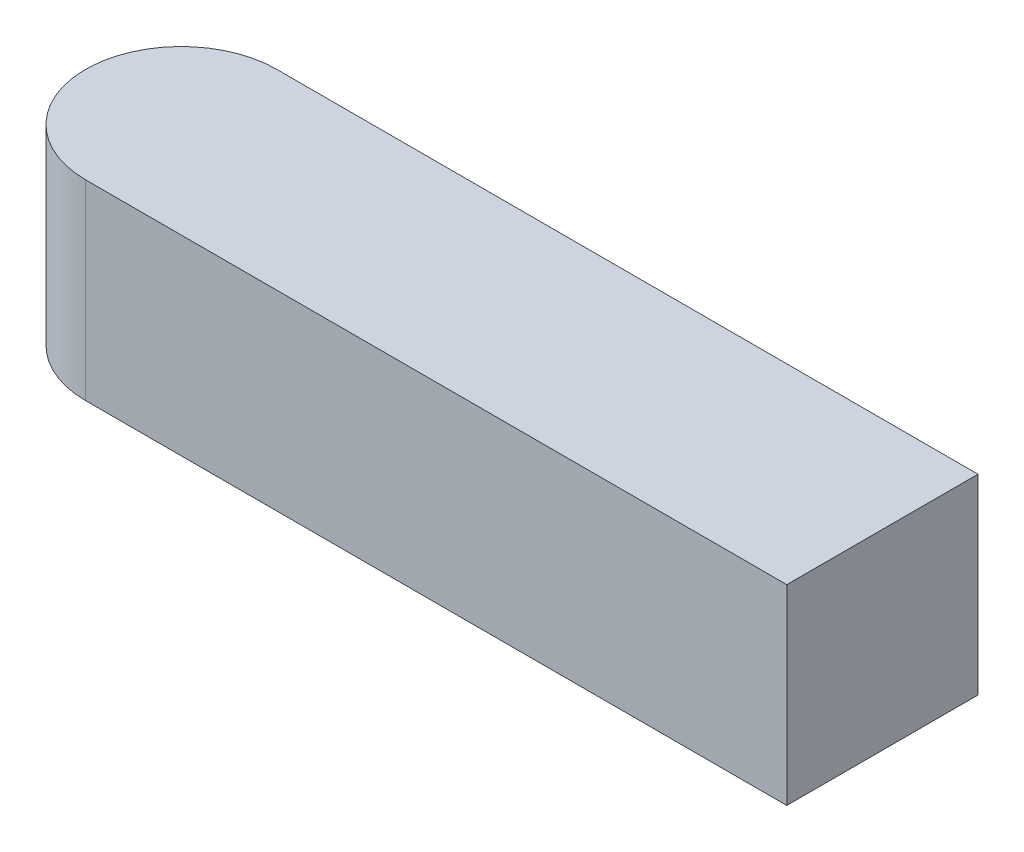
ISO-10303-21;
HEADER;
FILE_DESCRIPTION(('STEP AP214'),'2;1');
FILE_NAME('part.step','',(''),(''),'','','');
FILE_SCHEMA(('AUTOMOTIVE_DESIGN { 1 0 10303 214 1 1 1 1 }'));
ENDSEC;
DATA;
#1=APPLICATION_CONTEXT('core data for automotive mechanical design processes');
#2=APPLICATION_PROTOCOL_DEFINITION('international standard','automotive_design',2000,#1);
#3=PRODUCT_CONTEXT('',#1,'mechanical');
#4=PRODUCT('Part','Part','',(#3));
#5=PRODUCT_RELATED_PRODUCT_CATEGORY('part','',(#4));
#6=PRODUCT_DEFINITION_FORMATION('','',#4);
#7=PRODUCT_DEFINITION_CONTEXT('part definition',#1,'design');
#8=PRODUCT_DEFINITION('design','',#6,#7);
#9=PRODUCT_DEFINITION_SHAPE('','',#8);
#10=(LENGTH_UNIT() NAMED_UNIT(*) SI_UNIT(.MILLI.,.METRE.));
#11=(NAMED_UNIT(*) PLANE_ANGLE_UNIT() SI_UNIT($,.RADIAN.));
#12=(NAMED_UNIT(*) SI_UNIT($,.STERADIAN.) SOLID_ANGLE_UNIT());
#13=UNCERTAINTY_MEASURE_WITH_UNIT(LENGTH_MEASURE(1.E-05),#10,'distance_accuracy_value','');
#14=(GEOMETRIC_REPRESENTATION_CONTEXT(3) GLOBAL_UNCERTAINTY_ASSIGNED_CONTEXT((#13)) GLOBAL_UNIT_ASSIGNED_CONTEXT((#10,
#11,#12)) REPRESENTATION_CONTEXT('',''));
#15=CARTESIAN_POINT('',(0.,0.,0.));
#16=DIRECTION('',(0.,0.,1.));
#17=DIRECTION('',(1.,0.,0.));
#18=AXIS2_PLACEMENT_3D('',#15,#16,#17);
#19=CARTESIAN_POINT('',(-44.,12.,0.));
#20=DIRECTION('',(0.,-1.,0.));
#21=DIRECTION('',(0.,0.,-1.));
#22=AXIS2_PLACEMENT_3D('',#19,#20,#21);
#23=CYLINDRICAL_SURFACE('',#22,6.00000000000002);
#24=CARTESIAN_POINT('',(-44.,0.,0.));
#25=DIRECTION('',(0.,1.,0.));
#26=DIRECTION('',(0.,0.,1.));
#27=AXIS2_PLACEMENT_3D('',#24,#25,#26);
#28=CIRCLE('',#27,6.00000000000002);
#29=CARTESIAN_POINT('',(-44.,0.,-6.00000000000002));
#30=VERTEX_POINT('',#29);
#31=CARTESIAN_POINT('',(-44.,0.,6.00000000000002));
#32=VERTEX_POINT('',#31);
#33=EDGE_CURVE('E84',#30,#32,#28,.T.);
#34=ORIENTED_EDGE('',*,*,#33,.T.);
#35=DIRECTION('',(0.,-1.,0.));
#36=VECTOR('',#35,1.);
#37=CARTESIAN_POINT('',(-44.,12.,6.00000000000002));
#38=LINE('',#37,#36);
#39=CARTESIAN_POINT('',(-44.,12.,6.00000000000002));
#40=VERTEX_POINT('',#39);
#41=EDGE_CURVE('E11',#40,#32,#38,.T.);
#42=ORIENTED_EDGE('',*,*,#41,.F.);
#43=CARTESIAN_POINT('',(-44.,12.,0.));
#44=DIRECTION('',(0.,1.,0.));
#45=DIRECTION('',(0.,0.,1.));
#46=AXIS2_PLACEMENT_3D('',#43,#44,#45);
#47=CIRCLE('',#46,6.00000000000002);
#48=CARTESIAN_POINT('',(-44.,12.,-6.00000000000002));
#49=VERTEX_POINT('',#48);
#50=EDGE_CURVE('E78',#49,#40,#47,.T.);
#51=ORIENTED_EDGE('',*,*,#50,.F.);
#52=DIRECTION('',(0.,-1.,0.));
#53=VECTOR('',#52,1.);
#54=CARTESIAN_POINT('',(-44.,12.,-6.00000000000002));
#55=LINE('',#54,#53);
#56=EDGE_CURVE('E40',#49,#30,#55,.T.);
#57=ORIENTED_EDGE('',*,*,#56,.T.);
#58=EDGE_LOOP('',(#34,#42,#51,#57));
#59=FACE_BOUND('',#58,.T.);
#60=ADVANCED_FACE('F33',(#59),#23,.T.);
#61=CARTESIAN_POINT('',(-44.,12.,6.00000000000002));
#62=DIRECTION('',(0.,0.,-1.));
#63=DIRECTION('',(-1.,0.,0.));
#64=AXIS2_PLACEMENT_3D('',#61,#62,#63);
#65=PLANE('',#64);
#66=DIRECTION('',(1.,0.,0.));
#67=VECTOR('',#66,1.);
#68=CARTESIAN_POINT('',(-44.,0.,6.00000000000002));
#69=LINE('',#68,#67);
#70=CARTESIAN_POINT('',(0.,0.,6.00000000000001));
#71=VERTEX_POINT('',#70);
#72=EDGE_CURVE('E79',#32,#71,#69,.T.);
#73=ORIENTED_EDGE('',*,*,#72,.T.);
#74=DIRECTION('',(0.,1.,0.));
#75=VECTOR('',#74,1.);
#76=CARTESIAN_POINT('',(0.,0.,6.00000000000002));
#77=LINE('',#76,#75);
#78=CARTESIAN_POINT('',(0.,12.,6.00000000000002));
#79=VERTEX_POINT('',#78);
#80=EDGE_CURVE('E47',#71,#79,#77,.T.);
#81=ORIENTED_EDGE('',*,*,#80,.T.);
#82=DIRECTION('',(1.,0.,0.));
#83=VECTOR('',#82,1.);
#84=CARTESIAN_POINT('',(-44.,12.,6.00000000000002));
#85=LINE('',#84,#83);
#86=EDGE_CURVE('E92',#40,#79,#85,.T.);
#87=ORIENTED_EDGE('',*,*,#86,.F.);
#88=ORIENTED_EDGE('',*,*,#41,.T.);
#89=EDGE_LOOP('',(#73,#81,#87,#88));
#90=FACE_BOUND('',#89,.T.);
#91=ADVANCED_FACE('F101',(#90),#65,.F.);
#92=CARTESIAN_POINT('',(-44.,12.,-6.00000000000002));
#93=DIRECTION('',(0.,0.,1.));
#94=DIRECTION('',(1.,0.,0.));
#95=AXIS2_PLACEMENT_3D('',#92,#93,#94);
#96=PLANE('',#95);
#97=DIRECTION('',(-1.,0.,0.));
#98=VECTOR('',#97,1.);
#99=CARTESIAN_POINT('',(-44.,12.,-6.00000000000002));
#100=LINE('',#99,#98);
#101=CARTESIAN_POINT('',(0.,12.,-6.00000000000002));
#102=VERTEX_POINT('',#101);
#103=EDGE_CURVE('E56',#102,#49,#100,.T.);
#104=ORIENTED_EDGE('',*,*,#103,.F.);
#105=DIRECTION('',(0.,1.,0.));
#106=VECTOR('',#105,1.);
#107=CARTESIAN_POINT('',(0.,0.,-6.00000000000002));
#108=LINE('',#107,#106);
#109=CARTESIAN_POINT('',(0.,0.,-6.00000000000002));
#110=VERTEX_POINT('',#109);
#111=EDGE_CURVE('E75',#110,#102,#108,.T.);
#112=ORIENTED_EDGE('',*,*,#111,.F.);
#113=DIRECTION('',(-1.,0.,0.));
#114=VECTOR('',#113,1.);
#115=CARTESIAN_POINT('',(-44.,0.,-6.00000000000002));
#116=LINE('',#115,#114);
#117=EDGE_CURVE('E70',#110,#30,#116,.T.);
#118=ORIENTED_EDGE('',*,*,#117,.T.);
#119=ORIENTED_EDGE('',*,*,#56,.F.);
#120=EDGE_LOOP('',(#104,#112,#118,#119));
#121=FACE_BOUND('',#120,.T.);
#122=ADVANCED_FACE('F72',(#121),#96,.F.);
#123=CARTESIAN_POINT('',(-44.,12.,0.));
#124=DIRECTION('',(0.,1.,0.));
#125=DIRECTION('',(0.,0.,1.));
#126=AXIS2_PLACEMENT_3D('',#123,#124,#125);
#127=PLANE('',#126);
#128=DIRECTION('',(0.,0.,1.));
#129=VECTOR('',#128,1.);
#130=CARTESIAN_POINT('',(0.,12.,-6.00000000000002));
#131=LINE('',#130,#129);
#132=EDGE_CURVE('E98',#102,#79,#131,.T.);
#133=ORIENTED_EDGE('',*,*,#132,.F.);
#134=ORIENTED_EDGE('',*,*,#103,.T.);
#135=ORIENTED_EDGE('',*,*,#50,.T.);
#136=ORIENTED_EDGE('',*,*,#86,.T.);
#137=EDGE_LOOP('',(#133,#134,#135,#136));
#138=FACE_BOUND('',#137,.T.);
#139=ADVANCED_FACE('F103',(#138),#127,.T.);
#140=CARTESIAN_POINT('',(-44.,0.,0.));
#141=DIRECTION('',(0.,1.,0.));
#142=DIRECTION('',(0.,0.,1.));
#143=AXIS2_PLACEMENT_3D('',#140,#141,#142);
#144=PLANE('',#143);
#145=ORIENTED_EDGE('',*,*,#117,.F.);
#146=DIRECTION('',(0.,0.,1.));
#147=VECTOR('',#146,1.);
#148=CARTESIAN_POINT('',(0.,0.,-6.00000000000002));
#149=LINE('',#148,#147);
#150=EDGE_CURVE('E96',#110,#71,#149,.T.);
#151=ORIENTED_EDGE('',*,*,#150,.T.);
#152=ORIENTED_EDGE('',*,*,#72,.F.);
#153=ORIENTED_EDGE('',*,*,#33,.F.);
#154=EDGE_LOOP('',(#145,#151,#152,#153));
#155=FACE_BOUND('',#154,.T.);
#156=ADVANCED_FACE('F85',(#155),#144,.F.);
#157=CARTESIAN_POINT('',(0.,0.,-6.00000000000002));
#158=DIRECTION('',(-1.,0.,0.));
#159=DIRECTION('',(0.,0.,1.));
#160=AXIS2_PLACEMENT_3D('',#157,#158,#159);
#161=PLANE('',#160);
#162=ORIENTED_EDGE('',*,*,#132,.T.);
#163=ORIENTED_EDGE('',*,*,#80,.F.);
#164=ORIENTED_EDGE('',*,*,#150,.F.);
#165=ORIENTED_EDGE('',*,*,#111,.T.);
#166=EDGE_LOOP('',(#162,#163,#164,#165));
#167=FACE_BOUND('',#166,.T.);
#168=ADVANCED_FACE('F111',(#167),#161,.F.);
#169=CLOSED_SHELL('',(#60,#91,#122,#139,#156,#168));
#170=MANIFOLD_SOLID_BREP('B2',#169);
#171=ADVANCED_BREP_SHAPE_REPRESENTATION('',(#18,#170),#14);
#172=SHAPE_DEFINITION_REPRESENTATION(#9,#171);
ENDSEC;
END-ISO-10303-21;
